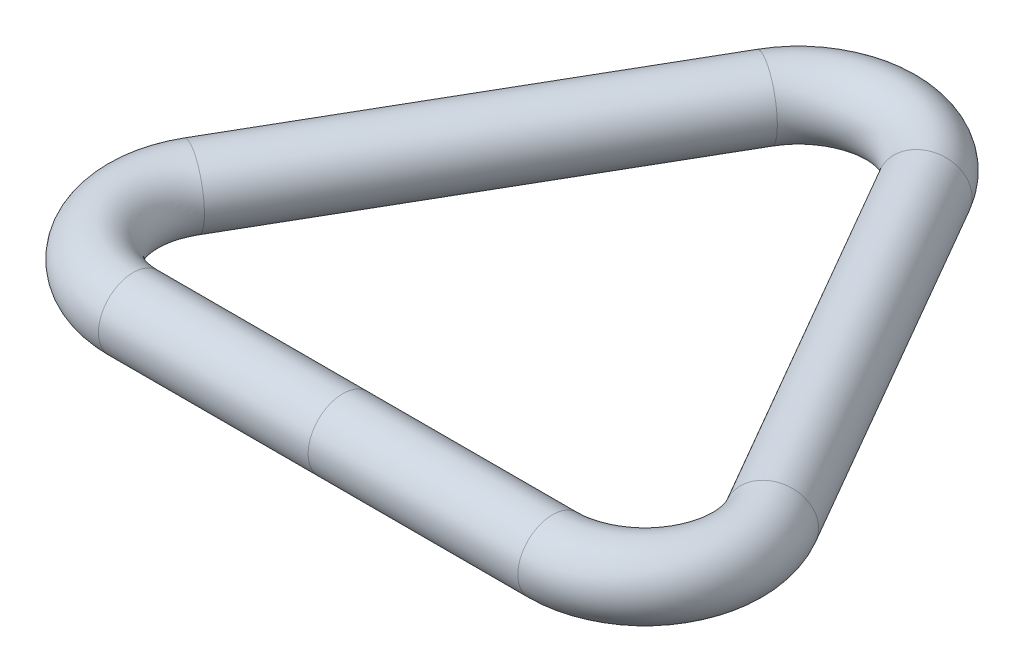
ISO-10303-21;
HEADER;
FILE_DESCRIPTION(('STEP AP214'),'2;1');
FILE_NAME('part.step','',(''),(''),'','','');
FILE_SCHEMA(('AUTOMOTIVE_DESIGN { 1 0 10303 214 1 1 1 1 }'));
ENDSEC;
DATA;
#1=APPLICATION_CONTEXT('core data for automotive mechanical design processes');
#2=APPLICATION_PROTOCOL_DEFINITION('international standard','automotive_design',2000,#1);
#3=PRODUCT_CONTEXT('',#1,'mechanical');
#4=PRODUCT('Part','Part','',(#3));
#5=PRODUCT_RELATED_PRODUCT_CATEGORY('part','',(#4));
#6=PRODUCT_DEFINITION_FORMATION('','',#4);
#7=PRODUCT_DEFINITION_CONTEXT('part definition',#1,'design');
#8=PRODUCT_DEFINITION('design','',#6,#7);
#9=PRODUCT_DEFINITION_SHAPE('','',#8);
#10=(LENGTH_UNIT() NAMED_UNIT(*) SI_UNIT(.MILLI.,.METRE.));
#11=(NAMED_UNIT(*) PLANE_ANGLE_UNIT() SI_UNIT($,.RADIAN.));
#12=(NAMED_UNIT(*) SI_UNIT($,.STERADIAN.) SOLID_ANGLE_UNIT());
#13=UNCERTAINTY_MEASURE_WITH_UNIT(LENGTH_MEASURE(1.E-05),#10,'distance_accuracy_value','');
#14=(GEOMETRIC_REPRESENTATION_CONTEXT(3) GLOBAL_UNCERTAINTY_ASSIGNED_CONTEXT((#13)) GLOBAL_UNIT_ASSIGNED_CONTEXT((#10,
#11,#12)) REPRESENTATION_CONTEXT('',''));
#15=CARTESIAN_POINT('',(0.,0.,0.));
#16=DIRECTION('',(0.,0.,1.));
#17=DIRECTION('',(1.,0.,0.));
#18=AXIS2_PLACEMENT_3D('',#15,#16,#17);
#19=CARTESIAN_POINT('',(28.8029547438753,0.,29.329393674833));
#20=DIRECTION('',(-1.,0.,0.));
#21=DIRECTION('',(0.,0.,1.));
#22=AXIS2_PLACEMENT_3D('',#19,#20,#21);
#23=CYLINDRICAL_SURFACE('',#22,4.7625);
#24=CARTESIAN_POINT('',(28.8029547438753,0.,29.329393674833));
#25=DIRECTION('',(1.,0.,0.));
#26=DIRECTION('',(0.,0.,-1.));
#27=AXIS2_PLACEMENT_3D('',#24,#25,#26);
#28=CIRCLE('',#27,4.7625);
#29=CARTESIAN_POINT('',(28.8029547438753,0.,34.091893674833));
#30=VERTEX_POINT('',#29);
#31=EDGE_CURVE('E41',#30,#30,#28,.T.);
#32=ORIENTED_EDGE('',*,*,#31,.F.);
#33=EDGE_LOOP('',(#32));
#34=FACE_BOUND('',#33,.T.);
#35=CARTESIAN_POINT('',(0.,0.,29.329393674833));
#36=DIRECTION('',(1.,0.,0.));
#37=DIRECTION('',(0.,0.,-1.));
#38=AXIS2_PLACEMENT_3D('',#35,#36,#37);
#39=CIRCLE('',#38,4.7625);
#40=CARTESIAN_POINT('',(0.,0.,24.566893674833));
#41=VERTEX_POINT('',#40);
#42=EDGE_CURVE('E10',#41,#41,#39,.T.);
#43=ORIENTED_EDGE('',*,*,#42,.T.);
#44=EDGE_LOOP('',(#43));
#45=FACE_BOUND('',#44,.T.);
#46=ADVANCED_FACE('F31',(#34,#45),#23,.T.);
#47=CARTESIAN_POINT('',(28.8029547438753,0.,16.629393674833));
#48=DIRECTION('',(0.,-1.,0.));
#49=DIRECTION('',(0.,0.,-1.));
#50=AXIS2_PLACEMENT_3D('',#47,#48,#49);
#51=TOROIDAL_SURFACE('',#50,12.7,4.7625);
#52=CARTESIAN_POINT('',(39.8014773719376,0.,10.279393674833));
#53=DIRECTION('',(-0.5,0.,-0.866025403784439));
#54=DIRECTION('',(-0.866025403784439,0.,0.5));
#55=AXIS2_PLACEMENT_3D('',#52,#53,#54);
#56=CIRCLE('',#55,4.7625);
#57=CARTESIAN_POINT('',(43.925923357461,0.,7.89814367483298));
#58=VERTEX_POINT('',#57);
#59=EDGE_CURVE('E46',#58,#58,#56,.T.);
#60=CARTESIAN_POINT('',(28.8029547438753,0.,16.629393674833));
#61=DIRECTION('',(0.,-1.,0.));
#62=DIRECTION('',(0.,0.,-1.));
#63=AXIS2_PLACEMENT_3D('',#60,#61,#62);
#64=CIRCLE('',#63,17.4625);
#65=EDGE_CURVE('',#58,#30,#64,.T.);
#66=ORIENTED_EDGE('',*,*,#59,.F.);
#67=ORIENTED_EDGE('',*,*,#31,.T.);
#68=ORIENTED_EDGE('',*,*,#65,.T.);
#69=ORIENTED_EDGE('',*,*,#65,.F.);
#70=EDGE_LOOP('',(#66,#68,#67,#69));
#71=FACE_BOUND('',#70,.T.);
#72=ADVANCED_FACE('F76',(#71),#51,.T.);
#73=CARTESIAN_POINT('',(10.9985226280624,0.,-39.608787349666));
#74=DIRECTION('',(0.500000000000001,0.,0.866025403784438));
#75=DIRECTION('',(0.866025403784438,0.,-0.500000000000001));
#76=AXIS2_PLACEMENT_3D('',#73,#74,#75);
#77=CYLINDRICAL_SURFACE('',#76,4.7625);
#78=CARTESIAN_POINT('',(10.9985226280624,0.,-39.608787349666));
#79=DIRECTION('',(-0.5,0.,-0.866025403784439));
#80=DIRECTION('',(-0.866025403784439,0.,0.5));
#81=AXIS2_PLACEMENT_3D('',#78,#79,#80);
#82=CIRCLE('',#81,4.7625);
#83=CARTESIAN_POINT('',(15.1229686135857,0.,-41.990037349666));
#84=VERTEX_POINT('',#83);
#85=EDGE_CURVE('E51',#84,#84,#82,.T.);
#86=ORIENTED_EDGE('',*,*,#85,.F.);
#87=EDGE_LOOP('',(#86));
#88=FACE_BOUND('',#87,.T.);
#89=ORIENTED_EDGE('',*,*,#59,.T.);
#90=EDGE_LOOP('',(#89));
#91=FACE_BOUND('',#90,.T.);
#92=ADVANCED_FACE('F81',(#88,#91),#77,.T.);
#93=CARTESIAN_POINT('',(0.,0.,-33.258787349666));
#94=DIRECTION('',(0.,-1.,0.));
#95=DIRECTION('',(0.,0.,-1.));
#96=AXIS2_PLACEMENT_3D('',#93,#94,#95);
#97=TOROIDAL_SURFACE('',#96,12.7,4.7625);
#98=CARTESIAN_POINT('',(-10.9985226280624,0.,-39.608787349666));
#99=DIRECTION('',(-0.5,0.,0.866025403784439));
#100=DIRECTION('',(0.866025403784439,0.,0.5));
#101=AXIS2_PLACEMENT_3D('',#98,#99,#100);
#102=CIRCLE('',#101,4.7625);
#103=CARTESIAN_POINT('',(-15.1229686135858,0.,-41.990037349666));
#104=VERTEX_POINT('',#103);
#105=EDGE_CURVE('E104',#104,#104,#102,.T.);
#106=CARTESIAN_POINT('',(0.,0.,-33.258787349666));
#107=DIRECTION('',(0.,-1.,0.));
#108=DIRECTION('',(0.,0.,-1.));
#109=AXIS2_PLACEMENT_3D('',#106,#107,#108);
#110=CIRCLE('',#109,17.4625);
#111=EDGE_CURVE('',#104,#84,#110,.T.);
#112=ORIENTED_EDGE('',*,*,#105,.F.);
#113=ORIENTED_EDGE('',*,*,#85,.T.);
#114=ORIENTED_EDGE('',*,*,#111,.T.);
#115=ORIENTED_EDGE('',*,*,#111,.F.);
#116=EDGE_LOOP('',(#112,#114,#113,#115));
#117=FACE_BOUND('',#116,.T.);
#118=ADVANCED_FACE('F86',(#117),#97,.T.);
#119=CARTESIAN_POINT('',(-39.8014773719376,0.,10.279393674833));
#120=DIRECTION('',(0.5,0.,-0.866025403784439));
#121=DIRECTION('',(-0.866025403784439,0.,-0.5));
#122=AXIS2_PLACEMENT_3D('',#119,#120,#121);
#123=CYLINDRICAL_SURFACE('',#122,4.7625);
#124=CARTESIAN_POINT('',(-39.8014773719376,0.,10.279393674833));
#125=DIRECTION('',(-0.5,0.,0.866025403784439));
#126=DIRECTION('',(0.866025403784439,0.,0.5));
#127=AXIS2_PLACEMENT_3D('',#124,#125,#126);
#128=CIRCLE('',#127,4.7625);
#129=CARTESIAN_POINT('',(-43.925923357461,0.,7.89814367483299));
#130=VERTEX_POINT('',#129);
#131=EDGE_CURVE('E101',#130,#130,#128,.T.);
#132=ORIENTED_EDGE('',*,*,#131,.F.);
#133=EDGE_LOOP('',(#132));
#134=FACE_BOUND('',#133,.T.);
#135=ORIENTED_EDGE('',*,*,#105,.T.);
#136=EDGE_LOOP('',(#135));
#137=FACE_BOUND('',#136,.T.);
#138=ADVANCED_FACE('F70',(#134,#137),#123,.T.);
#139=CARTESIAN_POINT('',(-28.8029547438752,0.,16.629393674833));
#140=DIRECTION('',(0.,-1.,0.));
#141=DIRECTION('',(0.,0.,-1.));
#142=AXIS2_PLACEMENT_3D('',#139,#140,#141);
#143=TOROIDAL_SURFACE('',#142,12.7,4.7625);
#144=CARTESIAN_POINT('',(-28.8029547438752,0.,29.329393674833));
#145=DIRECTION('',(1.,0.,0.));
#146=DIRECTION('',(0.,0.,-1.));
#147=AXIS2_PLACEMENT_3D('',#144,#145,#146);
#148=CIRCLE('',#147,4.7625);
#149=CARTESIAN_POINT('',(-28.8029547438752,0.,34.091893674833));
#150=VERTEX_POINT('',#149);
#151=EDGE_CURVE('E107',#150,#150,#148,.T.);
#152=CARTESIAN_POINT('',(-28.8029547438752,0.,16.629393674833));
#153=DIRECTION('',(0.,-1.,0.));
#154=DIRECTION('',(0.,0.,-1.));
#155=AXIS2_PLACEMENT_3D('',#152,#153,#154);
#156=CIRCLE('',#155,17.4625);
#157=EDGE_CURVE('',#150,#130,#156,.T.);
#158=ORIENTED_EDGE('',*,*,#151,.F.);
#159=ORIENTED_EDGE('',*,*,#131,.T.);
#160=ORIENTED_EDGE('',*,*,#157,.T.);
#161=ORIENTED_EDGE('',*,*,#157,.F.);
#162=EDGE_LOOP('',(#158,#160,#159,#161));
#163=FACE_BOUND('',#162,.T.);
#164=ADVANCED_FACE('F65',(#163),#143,.T.);
#165=CARTESIAN_POINT('',(-28.8029547438752,0.,29.329393674833));
#166=DIRECTION('',(1.,0.,0.));
#167=DIRECTION('',(0.,0.,-1.));
#168=AXIS2_PLACEMENT_3D('',#165,#166,#167);
#169=CYLINDRICAL_SURFACE('',#168,4.7625);
#170=ORIENTED_EDGE('',*,*,#151,.T.);
#171=EDGE_LOOP('',(#170));
#172=FACE_BOUND('',#171,.T.);
#173=ORIENTED_EDGE('',*,*,#42,.F.);
#174=EDGE_LOOP('',(#173));
#175=FACE_BOUND('',#174,.T.);
#176=ADVANCED_FACE('F63',(#172,#175),#169,.T.);
#177=CLOSED_SHELL('',(#46,#72,#92,#118,#138,#164,#176));
#178=MANIFOLD_SOLID_BREP('B2',#177);
#179=ADVANCED_BREP_SHAPE_REPRESENTATION('',(#18,#178),#14);
#180=SHAPE_DEFINITION_REPRESENTATION(#9,#179);
ENDSEC;
END-ISO-10303-21;
